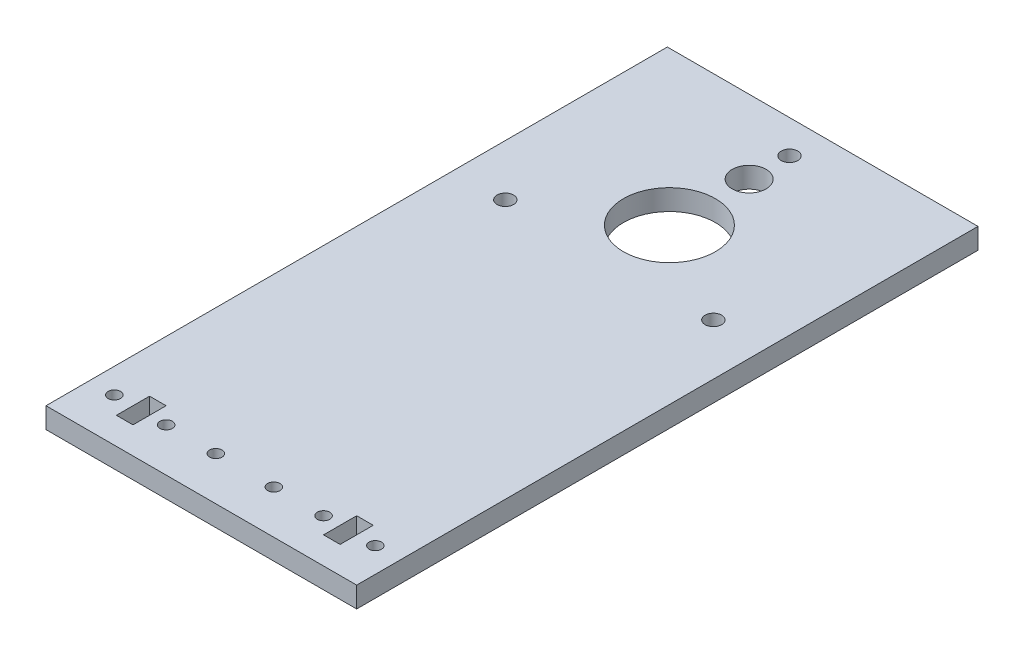
ISO-10303-21;
HEADER;
FILE_DESCRIPTION(('STEP AP214'),'2;1');
FILE_NAME('part.step','',(''),(''),'','','');
FILE_SCHEMA(('AUTOMOTIVE_DESIGN { 1 0 10303 214 1 1 1 1 }'));
ENDSEC;
DATA;
#1=APPLICATION_CONTEXT('core data for automotive mechanical design processes');
#2=APPLICATION_PROTOCOL_DEFINITION('international standard','automotive_design',2000,#1);
#3=PRODUCT_CONTEXT('',#1,'mechanical');
#4=PRODUCT('Part','Part','',(#3));
#5=PRODUCT_RELATED_PRODUCT_CATEGORY('part','',(#4));
#6=PRODUCT_DEFINITION_FORMATION('','',#4);
#7=PRODUCT_DEFINITION_CONTEXT('part definition',#1,'design');
#8=PRODUCT_DEFINITION('design','',#6,#7);
#9=PRODUCT_DEFINITION_SHAPE('','',#8);
#10=(LENGTH_UNIT() NAMED_UNIT(*) SI_UNIT(.MILLI.,.METRE.));
#11=(NAMED_UNIT(*) PLANE_ANGLE_UNIT() SI_UNIT($,.RADIAN.));
#12=(NAMED_UNIT(*) SI_UNIT($,.STERADIAN.) SOLID_ANGLE_UNIT());
#13=UNCERTAINTY_MEASURE_WITH_UNIT(LENGTH_MEASURE(1.E-05),#10,'distance_accuracy_value','');
#14=(GEOMETRIC_REPRESENTATION_CONTEXT(3) GLOBAL_UNCERTAINTY_ASSIGNED_CONTEXT((#13)) GLOBAL_UNIT_ASSIGNED_CONTEXT((#10,
#11,#12)) REPRESENTATION_CONTEXT('',''));
#15=CARTESIAN_POINT('',(0.,0.,0.));
#16=DIRECTION('',(0.,0.,1.));
#17=DIRECTION('',(1.,0.,0.));
#18=AXIS2_PLACEMENT_3D('',#15,#16,#17);
#19=CARTESIAN_POINT('',(10.5,5.,0.));
#20=DIRECTION('',(-1.,0.,0.));
#21=DIRECTION('',(0.,0.,1.));
#22=AXIS2_PLACEMENT_3D('',#19,#20,#21);
#23=PLANE('',#22);
#24=DIRECTION('',(0.,0.,-1.));
#25=VECTOR('',#24,1.);
#26=CARTESIAN_POINT('',(10.5,0.,0.));
#27=LINE('',#26,#25);
#28=CARTESIAN_POINT('',(10.5,0.,-6.50000000000001));
#29=VERTEX_POINT('',#28);
#30=CARTESIAN_POINT('',(10.5,0.,-14.5));
#31=VERTEX_POINT('',#30);
#32=EDGE_CURVE('E229',#29,#31,#27,.T.);
#33=ORIENTED_EDGE('',*,*,#32,.T.);
#34=DIRECTION('',(0.,-1.,0.));
#35=VECTOR('',#34,1.);
#36=CARTESIAN_POINT('',(10.5,5.,-14.5));
#37=LINE('',#36,#35);
#38=CARTESIAN_POINT('',(10.5,5.,-14.5));
#39=VERTEX_POINT('',#38);
#40=EDGE_CURVE('E11',#39,#31,#37,.T.);
#41=ORIENTED_EDGE('',*,*,#40,.F.);
#42=DIRECTION('',(0.,0.,-1.));
#43=VECTOR('',#42,1.);
#44=CARTESIAN_POINT('',(10.5,5.,0.));
#45=LINE('',#44,#43);
#46=CARTESIAN_POINT('',(10.5,5.,-6.50000000000001));
#47=VERTEX_POINT('',#46);
#48=EDGE_CURVE('E148',#47,#39,#45,.T.);
#49=ORIENTED_EDGE('',*,*,#48,.F.);
#50=DIRECTION('',(0.,-1.,0.));
#51=VECTOR('',#50,1.);
#52=CARTESIAN_POINT('',(10.5,5.,-6.50000000000001));
#53=LINE('',#52,#51);
#54=EDGE_CURVE('E247',#47,#29,#53,.T.);
#55=ORIENTED_EDGE('',*,*,#54,.T.);
#56=EDGE_LOOP('',(#33,#41,#49,#55));
#57=FACE_BOUND('',#56,.T.);
#58=ADVANCED_FACE('F40',(#57),#23,.F.);
#59=CARTESIAN_POINT('',(0.,5.,-14.5));
#60=DIRECTION('',(0.,0.,-1.));
#61=DIRECTION('',(-1.,0.,0.));
#62=AXIS2_PLACEMENT_3D('',#59,#60,#61);
#63=PLANE('',#62);
#64=DIRECTION('',(1.,0.,0.));
#65=VECTOR('',#64,1.);
#66=CARTESIAN_POINT('',(0.,0.,-14.5));
#67=LINE('',#66,#65);
#68=CARTESIAN_POINT('',(14.5,0.,-14.5));
#69=VERTEX_POINT('',#68);
#70=EDGE_CURVE('E154',#31,#69,#67,.T.);
#71=ORIENTED_EDGE('',*,*,#70,.T.);
#72=DIRECTION('',(0.,-1.,0.));
#73=VECTOR('',#72,1.);
#74=CARTESIAN_POINT('',(14.5,5.,-14.5));
#75=LINE('',#74,#73);
#76=CARTESIAN_POINT('',(14.5,5.,-14.5));
#77=VERTEX_POINT('',#76);
#78=EDGE_CURVE('E51',#77,#69,#75,.T.);
#79=ORIENTED_EDGE('',*,*,#78,.F.);
#80=DIRECTION('',(1.,0.,0.));
#81=VECTOR('',#80,1.);
#82=CARTESIAN_POINT('',(0.,5.,-14.5));
#83=LINE('',#82,#81);
#84=EDGE_CURVE('E141',#39,#77,#83,.T.);
#85=ORIENTED_EDGE('',*,*,#84,.F.);
#86=ORIENTED_EDGE('',*,*,#40,.T.);
#87=EDGE_LOOP('',(#71,#79,#85,#86));
#88=FACE_BOUND('',#87,.T.);
#89=ADVANCED_FACE('F153',(#88),#63,.F.);
#90=CARTESIAN_POINT('',(14.5,5.,0.));
#91=DIRECTION('',(1.,0.,0.));
#92=DIRECTION('',(0.,0.,-1.));
#93=AXIS2_PLACEMENT_3D('',#90,#91,#92);
#94=PLANE('',#93);
#95=DIRECTION('',(0.,0.,1.));
#96=VECTOR('',#95,1.);
#97=CARTESIAN_POINT('',(14.5,0.,0.));
#98=LINE('',#97,#96);
#99=CARTESIAN_POINT('',(14.5,0.,-6.50000000000001));
#100=VERTEX_POINT('',#99);
#101=EDGE_CURVE('E101',#69,#100,#98,.T.);
#102=ORIENTED_EDGE('',*,*,#101,.T.);
#103=DIRECTION('',(0.,-1.,0.));
#104=VECTOR('',#103,1.);
#105=CARTESIAN_POINT('',(14.5,5.,-6.50000000000001));
#106=LINE('',#105,#104);
#107=CARTESIAN_POINT('',(14.5,5.,-6.50000000000001));
#108=VERTEX_POINT('',#107);
#109=EDGE_CURVE('E156',#108,#100,#106,.T.);
#110=ORIENTED_EDGE('',*,*,#109,.F.);
#111=DIRECTION('',(0.,0.,1.));
#112=VECTOR('',#111,1.);
#113=CARTESIAN_POINT('',(14.5,5.,0.));
#114=LINE('',#113,#112);
#115=EDGE_CURVE('E146',#77,#108,#114,.T.);
#116=ORIENTED_EDGE('',*,*,#115,.F.);
#117=ORIENTED_EDGE('',*,*,#78,.T.);
#118=EDGE_LOOP('',(#102,#110,#116,#117));
#119=FACE_BOUND('',#118,.T.);
#120=ADVANCED_FACE('F158',(#119),#94,.F.);
#121=CARTESIAN_POINT('',(64.5,5.,0.));
#122=DIRECTION('',(-1.,0.,0.));
#123=DIRECTION('',(0.,0.,1.));
#124=AXIS2_PLACEMENT_3D('',#121,#122,#123);
#125=PLANE('',#124);
#126=DIRECTION('',(0.,0.,-1.));
#127=VECTOR('',#126,1.);
#128=CARTESIAN_POINT('',(64.5,0.,0.));
#129=LINE('',#128,#127);
#130=CARTESIAN_POINT('',(64.5,0.,-6.50000000000002));
#131=VERTEX_POINT('',#130);
#132=CARTESIAN_POINT('',(64.5,0.,-14.5));
#133=VERTEX_POINT('',#132);
#134=EDGE_CURVE('E197',#131,#133,#129,.T.);
#135=ORIENTED_EDGE('',*,*,#134,.F.);
#136=DIRECTION('',(0.,-1.,0.));
#137=VECTOR('',#136,1.);
#138=CARTESIAN_POINT('',(64.5,5.,-6.50000000000002));
#139=LINE('',#138,#137);
#140=CARTESIAN_POINT('',(64.5,5.,-6.50000000000002));
#141=VERTEX_POINT('',#140);
#142=EDGE_CURVE('E250',#141,#131,#139,.T.);
#143=ORIENTED_EDGE('',*,*,#142,.F.);
#144=DIRECTION('',(0.,0.,-1.));
#145=VECTOR('',#144,1.);
#146=CARTESIAN_POINT('',(64.5,5.,0.));
#147=LINE('',#146,#145);
#148=CARTESIAN_POINT('',(64.5,5.,-14.5));
#149=VERTEX_POINT('',#148);
#150=EDGE_CURVE('E401',#141,#149,#147,.T.);
#151=ORIENTED_EDGE('',*,*,#150,.T.);
#152=DIRECTION('',(0.,-1.,0.));
#153=VECTOR('',#152,1.);
#154=CARTESIAN_POINT('',(64.5,5.,-14.5));
#155=LINE('',#154,#153);
#156=EDGE_CURVE('E253',#149,#133,#155,.T.);
#157=ORIENTED_EDGE('',*,*,#156,.T.);
#158=EDGE_LOOP('',(#135,#143,#151,#157));
#159=FACE_BOUND('',#158,.T.);
#160=ADVANCED_FACE('F339',(#159),#125,.T.);
#161=CARTESIAN_POINT('',(0.,5.,-6.50000000000002));
#162=DIRECTION('',(0.,0.,-1.));
#163=DIRECTION('',(-1.,0.,0.));
#164=AXIS2_PLACEMENT_3D('',#161,#162,#163);
#165=PLANE('',#164);
#166=DIRECTION('',(1.,0.,0.));
#167=VECTOR('',#166,1.);
#168=CARTESIAN_POINT('',(0.,0.,-6.50000000000002));
#169=LINE('',#168,#167);
#170=CARTESIAN_POINT('',(60.5,0.,-6.50000000000002));
#171=VERTEX_POINT('',#170);
#172=EDGE_CURVE('E201',#171,#131,#169,.T.);
#173=ORIENTED_EDGE('',*,*,#172,.F.);
#174=DIRECTION('',(0.,-1.,0.));
#175=VECTOR('',#174,1.);
#176=CARTESIAN_POINT('',(60.5,5.,-6.50000000000002));
#177=LINE('',#176,#175);
#178=CARTESIAN_POINT('',(60.5,5.,-6.50000000000002));
#179=VERTEX_POINT('',#178);
#180=EDGE_CURVE('E260',#179,#171,#177,.T.);
#181=ORIENTED_EDGE('',*,*,#180,.F.);
#182=DIRECTION('',(1.,0.,0.));
#183=VECTOR('',#182,1.);
#184=CARTESIAN_POINT('',(0.,5.,-6.50000000000002));
#185=LINE('',#184,#183);
#186=EDGE_CURVE('E405',#179,#141,#185,.T.);
#187=ORIENTED_EDGE('',*,*,#186,.T.);
#188=ORIENTED_EDGE('',*,*,#142,.T.);
#189=EDGE_LOOP('',(#173,#181,#187,#188));
#190=FACE_BOUND('',#189,.T.);
#191=ADVANCED_FACE('F335',(#190),#165,.T.);
#192=CARTESIAN_POINT('',(60.5,5.,0.));
#193=DIRECTION('',(1.,0.,0.));
#194=DIRECTION('',(0.,0.,-1.));
#195=AXIS2_PLACEMENT_3D('',#192,#193,#194);
#196=PLANE('',#195);
#197=DIRECTION('',(0.,0.,1.));
#198=VECTOR('',#197,1.);
#199=CARTESIAN_POINT('',(60.5,0.,0.));
#200=LINE('',#199,#198);
#201=CARTESIAN_POINT('',(60.5,0.,-14.5));
#202=VERTEX_POINT('',#201);
#203=EDGE_CURVE('E205',#202,#171,#200,.T.);
#204=ORIENTED_EDGE('',*,*,#203,.F.);
#205=DIRECTION('',(0.,-1.,0.));
#206=VECTOR('',#205,1.);
#207=CARTESIAN_POINT('',(60.5,5.,-14.5));
#208=LINE('',#207,#206);
#209=CARTESIAN_POINT('',(60.5,5.,-14.5));
#210=VERTEX_POINT('',#209);
#211=EDGE_CURVE('E256',#210,#202,#208,.T.);
#212=ORIENTED_EDGE('',*,*,#211,.F.);
#213=DIRECTION('',(0.,0.,1.));
#214=VECTOR('',#213,1.);
#215=CARTESIAN_POINT('',(60.5,5.,0.));
#216=LINE('',#215,#214);
#217=EDGE_CURVE('E409',#210,#179,#216,.T.);
#218=ORIENTED_EDGE('',*,*,#217,.T.);
#219=ORIENTED_EDGE('',*,*,#180,.T.);
#220=EDGE_LOOP('',(#204,#212,#218,#219));
#221=FACE_BOUND('',#220,.T.);
#222=ADVANCED_FACE('F332',(#221),#196,.T.);
#223=CARTESIAN_POINT('',(0.,5.,0.));
#224=DIRECTION('',(0.,0.,-1.));
#225=DIRECTION('',(-1.,0.,0.));
#226=AXIS2_PLACEMENT_3D('',#223,#224,#225);
#227=PLANE('',#226);
#228=DIRECTION('',(1.,0.,0.));
#229=VECTOR('',#228,1.);
#230=CARTESIAN_POINT('',(0.,0.,0.));
#231=LINE('',#230,#229);
#232=CARTESIAN_POINT('',(0.,0.,0.));
#233=VERTEX_POINT('',#232);
#234=CARTESIAN_POINT('',(75.,0.,0.));
#235=VERTEX_POINT('',#234);
#236=EDGE_CURVE('E176',#233,#235,#231,.T.);
#237=ORIENTED_EDGE('',*,*,#236,.T.);
#238=DIRECTION('',(0.,-1.,0.));
#239=VECTOR('',#238,1.);
#240=CARTESIAN_POINT('',(75.,5.,0.));
#241=LINE('',#240,#239);
#242=CARTESIAN_POINT('',(75.,5.,0.));
#243=VERTEX_POINT('',#242);
#244=EDGE_CURVE('E257',#243,#235,#241,.T.);
#245=ORIENTED_EDGE('',*,*,#244,.F.);
#246=DIRECTION('',(1.,0.,0.));
#247=VECTOR('',#246,1.);
#248=CARTESIAN_POINT('',(0.,5.,0.));
#249=LINE('',#248,#247);
#250=CARTESIAN_POINT('',(0.,5.,0.));
#251=VERTEX_POINT('',#250);
#252=EDGE_CURVE('E246',#251,#243,#249,.T.);
#253=ORIENTED_EDGE('',*,*,#252,.F.);
#254=DIRECTION('',(0.,-1.,0.));
#255=VECTOR('',#254,1.);
#256=CARTESIAN_POINT('',(0.,5.,0.));
#257=LINE('',#256,#255);
#258=EDGE_CURVE('E175',#251,#233,#257,.T.);
#259=ORIENTED_EDGE('',*,*,#258,.T.);
#260=EDGE_LOOP('',(#237,#245,#253,#259));
#261=FACE_BOUND('',#260,.T.);
#262=ADVANCED_FACE('F42',(#261),#227,.F.);
#263=CARTESIAN_POINT('',(75.,5.,0.));
#264=DIRECTION('',(-1.,0.,0.));
#265=DIRECTION('',(0.,0.,1.));
#266=AXIS2_PLACEMENT_3D('',#263,#264,#265);
#267=PLANE('',#266);
#268=DIRECTION('',(0.,0.,-1.));
#269=VECTOR('',#268,1.);
#270=CARTESIAN_POINT('',(75.,0.,0.));
#271=LINE('',#270,#269);
#272=CARTESIAN_POINT('',(75.,0.,-150.));
#273=VERTEX_POINT('',#272);
#274=EDGE_CURVE('E180',#235,#273,#271,.T.);
#275=ORIENTED_EDGE('',*,*,#274,.T.);
#276=DIRECTION('',(0.,-1.,0.));
#277=VECTOR('',#276,1.);
#278=CARTESIAN_POINT('',(75.,5.,-150.));
#279=LINE('',#278,#277);
#280=CARTESIAN_POINT('',(75.,5.,-150.));
#281=VERTEX_POINT('',#280);
#282=EDGE_CURVE('E272',#281,#273,#279,.T.);
#283=ORIENTED_EDGE('',*,*,#282,.F.);
#284=DIRECTION('',(0.,0.,-1.));
#285=VECTOR('',#284,1.);
#286=CARTESIAN_POINT('',(75.,5.,0.));
#287=LINE('',#286,#285);
#288=EDGE_CURVE('E116',#243,#281,#287,.T.);
#289=ORIENTED_EDGE('',*,*,#288,.F.);
#290=ORIENTED_EDGE('',*,*,#244,.T.);
#291=EDGE_LOOP('',(#275,#283,#289,#290));
#292=FACE_BOUND('',#291,.T.);
#293=ADVANCED_FACE('F359',(#292),#267,.F.);
#294=CARTESIAN_POINT('',(0.,5.,-150.));
#295=DIRECTION('',(0.,0.,1.));
#296=DIRECTION('',(1.,0.,0.));
#297=AXIS2_PLACEMENT_3D('',#294,#295,#296);
#298=PLANE('',#297);
#299=DIRECTION('',(-1.,0.,0.));
#300=VECTOR('',#299,1.);
#301=CARTESIAN_POINT('',(0.,0.,-150.));
#302=LINE('',#301,#300);
#303=CARTESIAN_POINT('',(0.,0.,-150.));
#304=VERTEX_POINT('',#303);
#305=EDGE_CURVE('E183',#273,#304,#302,.T.);
#306=ORIENTED_EDGE('',*,*,#305,.T.);
#307=DIRECTION('',(0.,-1.,0.));
#308=VECTOR('',#307,1.);
#309=CARTESIAN_POINT('',(0.,5.,-150.));
#310=LINE('',#309,#308);
#311=CARTESIAN_POINT('',(0.,5.,-150.));
#312=VERTEX_POINT('',#311);
#313=EDGE_CURVE('E268',#312,#304,#310,.T.);
#314=ORIENTED_EDGE('',*,*,#313,.F.);
#315=DIRECTION('',(-1.,0.,0.));
#316=VECTOR('',#315,1.);
#317=CARTESIAN_POINT('',(0.,5.,-150.));
#318=LINE('',#317,#316);
#319=EDGE_CURVE('E372',#281,#312,#318,.T.);
#320=ORIENTED_EDGE('',*,*,#319,.F.);
#321=ORIENTED_EDGE('',*,*,#282,.T.);
#322=EDGE_LOOP('',(#306,#314,#320,#321));
#323=FACE_BOUND('',#322,.T.);
#324=ADVANCED_FACE('F356',(#323),#298,.F.);
#325=CARTESIAN_POINT('',(30.5,5.,-10.5));
#326=DIRECTION('',(0.,-1.,0.));
#327=DIRECTION('',(0.,0.,-1.));
#328=AXIS2_PLACEMENT_3D('',#325,#326,#327);
#329=CYLINDRICAL_SURFACE('',#328,1.5);
#330=CARTESIAN_POINT('',(30.5,5.,-10.5));
#331=DIRECTION('',(0.,1.,0.));
#332=DIRECTION('',(0.,0.,1.));
#333=AXIS2_PLACEMENT_3D('',#330,#331,#332);
#334=CIRCLE('',#333,1.5);
#335=CARTESIAN_POINT('',(30.5,5.,-9.00000000000001));
#336=VERTEX_POINT('',#335);
#337=EDGE_CURVE('E164',#336,#336,#334,.F.);
#338=ORIENTED_EDGE('',*,*,#337,.F.);
#339=EDGE_LOOP('',(#338));
#340=FACE_BOUND('',#339,.T.);
#341=CARTESIAN_POINT('',(30.5,0.,-10.5));
#342=DIRECTION('',(0.,1.,0.));
#343=DIRECTION('',(0.,0.,1.));
#344=AXIS2_PLACEMENT_3D('',#341,#342,#343);
#345=CIRCLE('',#344,1.5);
#346=CARTESIAN_POINT('',(30.5,0.,-9.00000000000001));
#347=VERTEX_POINT('',#346);
#348=EDGE_CURVE('E238',#347,#347,#345,.F.);
#349=ORIENTED_EDGE('',*,*,#348,.T.);
#350=EDGE_LOOP('',(#349));
#351=FACE_BOUND('',#350,.T.);
#352=ADVANCED_FACE('F358',(#340,#351),#329,.F.);
#353=CARTESIAN_POINT('',(0.,5.,-6.50000000000001));
#354=DIRECTION('',(0.,0.,1.));
#355=DIRECTION('',(1.,0.,0.));
#356=AXIS2_PLACEMENT_3D('',#353,#354,#355);
#357=PLANE('',#356);
#358=DIRECTION('',(-1.,0.,0.));
#359=VECTOR('',#358,1.);
#360=CARTESIAN_POINT('',(0.,0.,-6.50000000000001));
#361=LINE('',#360,#359);
#362=EDGE_CURVE('E107',#100,#29,#361,.T.);
#363=ORIENTED_EDGE('',*,*,#362,.T.);
#364=ORIENTED_EDGE('',*,*,#54,.F.);
#365=DIRECTION('',(-1.,0.,0.));
#366=VECTOR('',#365,1.);
#367=CARTESIAN_POINT('',(0.,5.,-6.50000000000001));
#368=LINE('',#367,#366);
#369=EDGE_CURVE('E60',#108,#47,#368,.T.);
#370=ORIENTED_EDGE('',*,*,#369,.F.);
#371=ORIENTED_EDGE('',*,*,#109,.T.);
#372=EDGE_LOOP('',(#363,#364,#370,#371));
#373=FACE_BOUND('',#372,.T.);
#374=ADVANCED_FACE('F314',(#373),#357,.F.);
#375=CARTESIAN_POINT('',(18.5,5.,-10.5));
#376=DIRECTION('',(0.,-1.,0.));
#377=DIRECTION('',(0.,0.,-1.));
#378=AXIS2_PLACEMENT_3D('',#375,#376,#377);
#379=CYLINDRICAL_SURFACE('',#378,1.5);
#380=CARTESIAN_POINT('',(18.5,5.,-10.5));
#381=DIRECTION('',(0.,1.,0.));
#382=DIRECTION('',(0.,0.,1.));
#383=AXIS2_PLACEMENT_3D('',#380,#381,#382);
#384=CIRCLE('',#383,1.5);
#385=CARTESIAN_POINT('',(18.5,5.,-9.00000000000001));
#386=VERTEX_POINT('',#385);
#387=EDGE_CURVE('E429',#386,#386,#384,.F.);
#388=ORIENTED_EDGE('',*,*,#387,.F.);
#389=EDGE_LOOP('',(#388));
#390=FACE_BOUND('',#389,.T.);
#391=CARTESIAN_POINT('',(18.5,0.,-10.5));
#392=DIRECTION('',(0.,1.,0.));
#393=DIRECTION('',(0.,0.,1.));
#394=AXIS2_PLACEMENT_3D('',#391,#392,#393);
#395=CIRCLE('',#394,1.5);
#396=CARTESIAN_POINT('',(18.5,0.,-9.00000000000001));
#397=VERTEX_POINT('',#396);
#398=EDGE_CURVE('E225',#397,#397,#395,.F.);
#399=ORIENTED_EDGE('',*,*,#398,.T.);
#400=EDGE_LOOP('',(#399));
#401=FACE_BOUND('',#400,.T.);
#402=ADVANCED_FACE('F310',(#390,#401),#379,.F.);
#403=CARTESIAN_POINT('',(69.,5.,-10.5));
#404=DIRECTION('',(0.,-1.,0.));
#405=DIRECTION('',(0.,0.,-1.));
#406=AXIS2_PLACEMENT_3D('',#403,#404,#405);
#407=CYLINDRICAL_SURFACE('',#406,1.5);
#408=CARTESIAN_POINT('',(69.,5.,-10.5));
#409=DIRECTION('',(0.,1.,0.));
#410=DIRECTION('',(0.,0.,1.));
#411=AXIS2_PLACEMENT_3D('',#408,#409,#410);
#412=CIRCLE('',#411,1.5);
#413=CARTESIAN_POINT('',(69.,5.,-9.00000000000002));
#414=VERTEX_POINT('',#413);
#415=EDGE_CURVE('E425',#414,#414,#412,.T.);
#416=ORIENTED_EDGE('',*,*,#415,.T.);
#417=EDGE_LOOP('',(#416));
#418=FACE_BOUND('',#417,.T.);
#419=CARTESIAN_POINT('',(69.,0.,-10.5));
#420=DIRECTION('',(0.,1.,0.));
#421=DIRECTION('',(0.,0.,1.));
#422=AXIS2_PLACEMENT_3D('',#419,#420,#421);
#423=CIRCLE('',#422,1.5);
#424=CARTESIAN_POINT('',(69.,0.,-9.00000000000002));
#425=VERTEX_POINT('',#424);
#426=EDGE_CURVE('E221',#425,#425,#423,.T.);
#427=ORIENTED_EDGE('',*,*,#426,.F.);
#428=EDGE_LOOP('',(#427));
#429=FACE_BOUND('',#428,.T.);
#430=ADVANCED_FACE('F313',(#418,#429),#407,.F.);
#431=CARTESIAN_POINT('',(37.5,5.,-132.25));
#432=DIRECTION('',(0.,-1.,0.));
#433=DIRECTION('',(0.,0.,-1.));
#434=AXIS2_PLACEMENT_3D('',#431,#432,#433);
#435=CYLINDRICAL_SURFACE('',#434,4.1);
#436=CARTESIAN_POINT('',(37.5,5.,-132.25));
#437=DIRECTION('',(0.,1.,0.));
#438=DIRECTION('',(0.,0.,1.));
#439=AXIS2_PLACEMENT_3D('',#436,#437,#438);
#440=CIRCLE('',#439,4.1);
#441=CARTESIAN_POINT('',(37.5,5.,-128.15));
#442=VERTEX_POINT('',#441);
#443=EDGE_CURVE('E421',#442,#442,#440,.T.);
#444=ORIENTED_EDGE('',*,*,#443,.T.);
#445=EDGE_LOOP('',(#444));
#446=FACE_BOUND('',#445,.T.);
#447=CARTESIAN_POINT('',(37.5,0.,-132.25));
#448=DIRECTION('',(0.,1.,0.));
#449=DIRECTION('',(0.,0.,1.));
#450=AXIS2_PLACEMENT_3D('',#447,#448,#449);
#451=CIRCLE('',#450,4.1);
#452=CARTESIAN_POINT('',(37.5,0.,-128.15));
#453=VERTEX_POINT('',#452);
#454=EDGE_CURVE('E217',#453,#453,#451,.T.);
#455=ORIENTED_EDGE('',*,*,#454,.F.);
#456=EDGE_LOOP('',(#455));
#457=FACE_BOUND('',#456,.T.);
#458=ADVANCED_FACE('F318',(#446,#457),#435,.F.);
#459=CARTESIAN_POINT('',(37.5,5.,-113.));
#460=DIRECTION('',(0.,-1.,0.));
#461=DIRECTION('',(0.,0.,-1.));
#462=AXIS2_PLACEMENT_3D('',#459,#460,#461);
#463=CYLINDRICAL_SURFACE('',#462,11.1);
#464=CARTESIAN_POINT('',(37.5,5.,-113.));
#465=DIRECTION('',(0.,1.,0.));
#466=DIRECTION('',(0.,0.,1.));
#467=AXIS2_PLACEMENT_3D('',#464,#465,#466);
#468=CIRCLE('',#467,11.1);
#469=CARTESIAN_POINT('',(37.5,5.,-101.9));
#470=VERTEX_POINT('',#469);
#471=EDGE_CURVE('E417',#470,#470,#468,.T.);
#472=ORIENTED_EDGE('',*,*,#471,.T.);
#473=EDGE_LOOP('',(#472));
#474=FACE_BOUND('',#473,.T.);
#475=CARTESIAN_POINT('',(37.5,0.,-113.));
#476=DIRECTION('',(0.,1.,0.));
#477=DIRECTION('',(0.,0.,1.));
#478=AXIS2_PLACEMENT_3D('',#475,#476,#477);
#479=CIRCLE('',#478,11.1);
#480=CARTESIAN_POINT('',(37.5,0.,-101.9));
#481=VERTEX_POINT('',#480);
#482=EDGE_CURVE('E213',#481,#481,#479,.T.);
#483=ORIENTED_EDGE('',*,*,#482,.F.);
#484=EDGE_LOOP('',(#483));
#485=FACE_BOUND('',#484,.T.);
#486=ADVANCED_FACE('F322',(#474,#485),#463,.F.);
#487=CARTESIAN_POINT('',(0.,5.,-14.4999999999998));
#488=DIRECTION('',(0.,0.,1.));
#489=DIRECTION('',(1.,0.,0.));
#490=AXIS2_PLACEMENT_3D('',#487,#488,#489);
#491=PLANE('',#490);
#492=DIRECTION('',(-1.,0.,0.));
#493=VECTOR('',#492,1.);
#494=CARTESIAN_POINT('',(0.,0.,-14.4999999999998));
#495=LINE('',#494,#493);
#496=EDGE_CURVE('E209',#133,#202,#495,.T.);
#497=ORIENTED_EDGE('',*,*,#496,.F.);
#498=ORIENTED_EDGE('',*,*,#156,.F.);
#499=DIRECTION('',(-1.,0.,0.));
#500=VECTOR('',#499,1.);
#501=CARTESIAN_POINT('',(0.,5.,-14.4999999999998));
#502=LINE('',#501,#500);
#503=EDGE_CURVE('E413',#149,#210,#502,.T.);
#504=ORIENTED_EDGE('',*,*,#503,.T.);
#505=ORIENTED_EDGE('',*,*,#211,.T.);
#506=EDGE_LOOP('',(#497,#498,#504,#505));
#507=FACE_BOUND('',#506,.T.);
#508=ADVANCED_FACE('F326',(#507),#491,.T.);
#509=CARTESIAN_POINT('',(56.5,5.,-10.5));
#510=DIRECTION('',(0.,-1.,0.));
#511=DIRECTION('',(0.,0.,-1.));
#512=AXIS2_PLACEMENT_3D('',#509,#510,#511);
#513=CYLINDRICAL_SURFACE('',#512,1.5);
#514=CARTESIAN_POINT('',(56.5,5.,-10.5));
#515=DIRECTION('',(0.,1.,0.));
#516=DIRECTION('',(0.,0.,1.));
#517=AXIS2_PLACEMENT_3D('',#514,#515,#516);
#518=CIRCLE('',#517,1.5);
#519=CARTESIAN_POINT('',(56.5,5.,-9.00000000000001));
#520=VERTEX_POINT('',#519);
#521=EDGE_CURVE('E397',#520,#520,#518,.T.);
#522=ORIENTED_EDGE('',*,*,#521,.T.);
#523=EDGE_LOOP('',(#522));
#524=FACE_BOUND('',#523,.T.);
#525=CARTESIAN_POINT('',(56.5,0.,-10.5));
#526=DIRECTION('',(0.,1.,0.));
#527=DIRECTION('',(0.,0.,1.));
#528=AXIS2_PLACEMENT_3D('',#525,#526,#527);
#529=CIRCLE('',#528,1.5);
#530=CARTESIAN_POINT('',(56.5,0.,-9.00000000000001));
#531=VERTEX_POINT('',#530);
#532=EDGE_CURVE('E193',#531,#531,#529,.T.);
#533=ORIENTED_EDGE('',*,*,#532,.F.);
#534=EDGE_LOOP('',(#533));
#535=FACE_BOUND('',#534,.T.);
#536=ADVANCED_FACE('F330',(#524,#535),#513,.F.);
#537=CARTESIAN_POINT('',(44.5,5.,-10.5));
#538=DIRECTION('',(0.,-1.,0.));
#539=DIRECTION('',(0.,0.,-1.));
#540=AXIS2_PLACEMENT_3D('',#537,#538,#539);
#541=CYLINDRICAL_SURFACE('',#540,1.5);
#542=CARTESIAN_POINT('',(44.5,5.,-10.5));
#543=DIRECTION('',(0.,1.,0.));
#544=DIRECTION('',(0.,0.,1.));
#545=AXIS2_PLACEMENT_3D('',#542,#543,#544);
#546=CIRCLE('',#545,1.5);
#547=CARTESIAN_POINT('',(44.5,5.,-9.00000000000001));
#548=VERTEX_POINT('',#547);
#549=EDGE_CURVE('E393',#548,#548,#546,.T.);
#550=ORIENTED_EDGE('',*,*,#549,.T.);
#551=EDGE_LOOP('',(#550));
#552=FACE_BOUND('',#551,.T.);
#553=CARTESIAN_POINT('',(44.5,0.,-10.5));
#554=DIRECTION('',(0.,1.,0.));
#555=DIRECTION('',(0.,0.,1.));
#556=AXIS2_PLACEMENT_3D('',#553,#554,#555);
#557=CIRCLE('',#556,1.5);
#558=CARTESIAN_POINT('',(44.5,0.,-9.00000000000001));
#559=VERTEX_POINT('',#558);
#560=EDGE_CURVE('E189',#559,#559,#557,.T.);
#561=ORIENTED_EDGE('',*,*,#560,.F.);
#562=EDGE_LOOP('',(#561));
#563=FACE_BOUND('',#562,.T.);
#564=ADVANCED_FACE('F346',(#552,#563),#541,.F.);
#565=CARTESIAN_POINT('',(0.,5.,0.));
#566=DIRECTION('',(1.,0.,0.));
#567=DIRECTION('',(0.,0.,-1.));
#568=AXIS2_PLACEMENT_3D('',#565,#566,#567);
#569=PLANE('',#568);
#570=DIRECTION('',(0.,0.,1.));
#571=VECTOR('',#570,1.);
#572=CARTESIAN_POINT('',(0.,0.,0.));
#573=LINE('',#572,#571);
#574=EDGE_CURVE('E186',#304,#233,#573,.T.);
#575=ORIENTED_EDGE('',*,*,#574,.T.);
#576=ORIENTED_EDGE('',*,*,#258,.F.);
#577=DIRECTION('',(0.,0.,1.));
#578=VECTOR('',#577,1.);
#579=CARTESIAN_POINT('',(0.,5.,0.));
#580=LINE('',#579,#578);
#581=EDGE_CURVE('E390',#312,#251,#580,.T.);
#582=ORIENTED_EDGE('',*,*,#581,.F.);
#583=ORIENTED_EDGE('',*,*,#313,.T.);
#584=EDGE_LOOP('',(#575,#576,#582,#583));
#585=FACE_BOUND('',#584,.T.);
#586=ADVANCED_FACE('F350',(#585),#569,.F.);
#587=CARTESIAN_POINT('',(5.99999999999999,5.,-10.5));
#588=DIRECTION('',(0.,-1.,0.));
#589=DIRECTION('',(0.,0.,-1.));
#590=AXIS2_PLACEMENT_3D('',#587,#588,#589);
#591=CYLINDRICAL_SURFACE('',#590,1.5);
#592=CARTESIAN_POINT('',(5.99999999999999,5.,-10.5));
#593=DIRECTION('',(0.,1.,0.));
#594=DIRECTION('',(0.,0.,1.));
#595=AXIS2_PLACEMENT_3D('',#592,#593,#594);
#596=CIRCLE('',#595,1.5);
#597=CARTESIAN_POINT('',(5.99999999999999,5.,-9.00000000000002));
#598=VERTEX_POINT('',#597);
#599=EDGE_CURVE('E171',#598,#598,#596,.F.);
#600=ORIENTED_EDGE('',*,*,#599,.F.);
#601=EDGE_LOOP('',(#600));
#602=FACE_BOUND('',#601,.T.);
#603=CARTESIAN_POINT('',(5.99999999999999,0.,-10.5));
#604=DIRECTION('',(0.,1.,0.));
#605=DIRECTION('',(0.,0.,1.));
#606=AXIS2_PLACEMENT_3D('',#603,#604,#605);
#607=CIRCLE('',#606,1.5);
#608=CARTESIAN_POINT('',(5.99999999999999,0.,-9.00000000000002));
#609=VERTEX_POINT('',#608);
#610=EDGE_CURVE('E242',#609,#609,#607,.F.);
#611=ORIENTED_EDGE('',*,*,#610,.T.);
#612=EDGE_LOOP('',(#611));
#613=FACE_BOUND('',#612,.T.);
#614=ADVANCED_FACE('F354',(#602,#613),#591,.F.);
#615=CARTESIAN_POINT('',(0.,5.,0.));
#616=DIRECTION('',(0.,1.,0.));
#617=DIRECTION('',(0.,0.,1.));
#618=AXIS2_PLACEMENT_3D('',#615,#616,#617);
#619=PLANE('',#618);
#620=CARTESIAN_POINT('',(12.3852632902524,5.,-98.4999999999995));
#621=DIRECTION('',(0.,1.,0.));
#622=DIRECTION('',(0.,0.,1.));
#623=AXIS2_PLACEMENT_3D('',#620,#621,#622);
#624=CIRCLE('',#623,2.00000000000002);
#625=CARTESIAN_POINT('',(12.3852632902524,5.,-96.4999999999995));
#626=VERTEX_POINT('',#625);
#627=EDGE_CURVE('E280',#626,#626,#624,.T.);
#628=ORIENTED_EDGE('',*,*,#627,.F.);
#629=EDGE_LOOP('',(#628));
#630=FACE_BOUND('',#629,.T.);
#631=CARTESIAN_POINT('',(62.6147367097498,5.,-98.5000000000006));
#632=DIRECTION('',(0.,1.,0.));
#633=DIRECTION('',(0.,0.,1.));
#634=AXIS2_PLACEMENT_3D('',#631,#632,#633);
#635=CIRCLE('',#634,2.);
#636=CARTESIAN_POINT('',(62.6147367097498,5.,-96.5000000000006));
#637=VERTEX_POINT('',#636);
#638=EDGE_CURVE('E582',#637,#637,#635,.T.);
#639=ORIENTED_EDGE('',*,*,#638,.F.);
#640=EDGE_LOOP('',(#639));
#641=FACE_BOUND('',#640,.T.);
#642=CARTESIAN_POINT('',(37.5,5.,-142.));
#643=DIRECTION('',(0.,1.,0.));
#644=DIRECTION('',(0.,0.,1.));
#645=AXIS2_PLACEMENT_3D('',#642,#643,#644);
#646=CIRCLE('',#645,2.);
#647=CARTESIAN_POINT('',(37.5,5.,-140.));
#648=VERTEX_POINT('',#647);
#649=EDGE_CURVE('E385',#648,#648,#646,.T.);
#650=ORIENTED_EDGE('',*,*,#649,.F.);
#651=EDGE_LOOP('',(#650));
#652=FACE_BOUND('',#651,.T.);
#653=ORIENTED_EDGE('',*,*,#252,.T.);
#654=ORIENTED_EDGE('',*,*,#288,.T.);
#655=ORIENTED_EDGE('',*,*,#319,.T.);
#656=ORIENTED_EDGE('',*,*,#581,.T.);
#657=EDGE_LOOP('',(#653,#654,#655,#656));
#658=FACE_BOUND('',#657,.T.);
#659=ORIENTED_EDGE('',*,*,#549,.F.);
#660=EDGE_LOOP('',(#659));
#661=FACE_BOUND('',#660,.T.);
#662=ORIENTED_EDGE('',*,*,#521,.F.);
#663=EDGE_LOOP('',(#662));
#664=FACE_BOUND('',#663,.T.);
#665=ORIENTED_EDGE('',*,*,#150,.F.);
#666=ORIENTED_EDGE('',*,*,#186,.F.);
#667=ORIENTED_EDGE('',*,*,#217,.F.);
#668=ORIENTED_EDGE('',*,*,#503,.F.);
#669=EDGE_LOOP('',(#665,#666,#667,#668));
#670=FACE_BOUND('',#669,.T.);
#671=ORIENTED_EDGE('',*,*,#471,.F.);
#672=EDGE_LOOP('',(#671));
#673=FACE_BOUND('',#672,.T.);
#674=ORIENTED_EDGE('',*,*,#443,.F.);
#675=EDGE_LOOP('',(#674));
#676=FACE_BOUND('',#675,.T.);
#677=ORIENTED_EDGE('',*,*,#415,.F.);
#678=EDGE_LOOP('',(#677));
#679=FACE_BOUND('',#678,.T.);
#680=ORIENTED_EDGE('',*,*,#387,.T.);
#681=EDGE_LOOP('',(#680));
#682=FACE_BOUND('',#681,.T.);
#683=ORIENTED_EDGE('',*,*,#48,.T.);
#684=ORIENTED_EDGE('',*,*,#84,.T.);
#685=ORIENTED_EDGE('',*,*,#115,.T.);
#686=ORIENTED_EDGE('',*,*,#369,.T.);
#687=EDGE_LOOP('',(#683,#684,#685,#686));
#688=FACE_BOUND('',#687,.T.);
#689=ORIENTED_EDGE('',*,*,#337,.T.);
#690=EDGE_LOOP('',(#689));
#691=FACE_BOUND('',#690,.T.);
#692=ORIENTED_EDGE('',*,*,#599,.T.);
#693=EDGE_LOOP('',(#692));
#694=FACE_BOUND('',#693,.T.);
#695=ADVANCED_FACE('F143',(#630,#641,#652,#658,#661,#664,#670,#673,#676,#679,#682,#688,#691,
#694),#619,.T.);
#696=CARTESIAN_POINT('',(0.,0.,0.));
#697=DIRECTION('',(0.,1.,0.));
#698=DIRECTION('',(0.,0.,1.));
#699=AXIS2_PLACEMENT_3D('',#696,#697,#698);
#700=PLANE('',#699);
#701=CARTESIAN_POINT('',(12.3852632902524,0.,-98.4999999999995));
#702=DIRECTION('',(0.,1.,0.));
#703=DIRECTION('',(0.,0.,1.));
#704=AXIS2_PLACEMENT_3D('',#701,#702,#703);
#705=CIRCLE('',#704,2.00000000000002);
#706=CARTESIAN_POINT('',(12.3852632902524,0.,-96.4999999999995));
#707=VERTEX_POINT('',#706);
#708=EDGE_CURVE('E44',#707,#707,#705,.T.);
#709=ORIENTED_EDGE('',*,*,#708,.T.);
#710=EDGE_LOOP('',(#709));
#711=FACE_BOUND('',#710,.T.);
#712=CARTESIAN_POINT('',(62.6147367097498,0.,-98.5000000000006));
#713=DIRECTION('',(0.,1.,0.));
#714=DIRECTION('',(0.,0.,1.));
#715=AXIS2_PLACEMENT_3D('',#712,#713,#714);
#716=CIRCLE('',#715,2.);
#717=CARTESIAN_POINT('',(62.6147367097498,0.,-96.5000000000006));
#718=VERTEX_POINT('',#717);
#719=EDGE_CURVE('E279',#718,#718,#716,.T.);
#720=ORIENTED_EDGE('',*,*,#719,.T.);
#721=EDGE_LOOP('',(#720));
#722=FACE_BOUND('',#721,.T.);
#723=CARTESIAN_POINT('',(37.5,0.,-142.));
#724=DIRECTION('',(0.,1.,0.));
#725=DIRECTION('',(0.,0.,1.));
#726=AXIS2_PLACEMENT_3D('',#723,#724,#725);
#727=CIRCLE('',#726,2.);
#728=CARTESIAN_POINT('',(37.5,0.,-140.));
#729=VERTEX_POINT('',#728);
#730=EDGE_CURVE('E277',#729,#729,#727,.T.);
#731=ORIENTED_EDGE('',*,*,#730,.T.);
#732=EDGE_LOOP('',(#731));
#733=FACE_BOUND('',#732,.T.);
#734=ORIENTED_EDGE('',*,*,#236,.F.);
#735=ORIENTED_EDGE('',*,*,#574,.F.);
#736=ORIENTED_EDGE('',*,*,#305,.F.);
#737=ORIENTED_EDGE('',*,*,#274,.F.);
#738=EDGE_LOOP('',(#734,#735,#736,#737));
#739=FACE_BOUND('',#738,.T.);
#740=ORIENTED_EDGE('',*,*,#560,.T.);
#741=EDGE_LOOP('',(#740));
#742=FACE_BOUND('',#741,.T.);
#743=ORIENTED_EDGE('',*,*,#532,.T.);
#744=EDGE_LOOP('',(#743));
#745=FACE_BOUND('',#744,.T.);
#746=ORIENTED_EDGE('',*,*,#134,.T.);
#747=ORIENTED_EDGE('',*,*,#496,.T.);
#748=ORIENTED_EDGE('',*,*,#203,.T.);
#749=ORIENTED_EDGE('',*,*,#172,.T.);
#750=EDGE_LOOP('',(#746,#747,#748,#749));
#751=FACE_BOUND('',#750,.T.);
#752=ORIENTED_EDGE('',*,*,#482,.T.);
#753=EDGE_LOOP('',(#752));
#754=FACE_BOUND('',#753,.T.);
#755=ORIENTED_EDGE('',*,*,#454,.T.);
#756=EDGE_LOOP('',(#755));
#757=FACE_BOUND('',#756,.T.);
#758=ORIENTED_EDGE('',*,*,#426,.T.);
#759=EDGE_LOOP('',(#758));
#760=FACE_BOUND('',#759,.T.);
#761=ORIENTED_EDGE('',*,*,#398,.F.);
#762=EDGE_LOOP('',(#761));
#763=FACE_BOUND('',#762,.T.);
#764=ORIENTED_EDGE('',*,*,#32,.F.);
#765=ORIENTED_EDGE('',*,*,#362,.F.);
#766=ORIENTED_EDGE('',*,*,#101,.F.);
#767=ORIENTED_EDGE('',*,*,#70,.F.);
#768=EDGE_LOOP('',(#764,#765,#766,#767));
#769=FACE_BOUND('',#768,.T.);
#770=ORIENTED_EDGE('',*,*,#348,.F.);
#771=EDGE_LOOP('',(#770));
#772=FACE_BOUND('',#771,.T.);
#773=ORIENTED_EDGE('',*,*,#610,.F.);
#774=EDGE_LOOP('',(#773));
#775=FACE_BOUND('',#774,.T.);
#776=ADVANCED_FACE('F287',(#711,#722,#733,#739,#742,#745,#751,#754,#757,#760,#763,#769,#772,
#775),#700,.F.);
#777=CARTESIAN_POINT('',(37.5,-5.,-142.));
#778=DIRECTION('',(0.,1.,0.));
#779=DIRECTION('',(0.,0.,1.));
#780=AXIS2_PLACEMENT_3D('',#777,#778,#779);
#781=CYLINDRICAL_SURFACE('',#780,2.);
#782=ORIENTED_EDGE('',*,*,#649,.T.);
#783=EDGE_LOOP('',(#782));
#784=FACE_BOUND('',#783,.T.);
#785=ORIENTED_EDGE('',*,*,#730,.F.);
#786=EDGE_LOOP('',(#785));
#787=FACE_BOUND('',#786,.T.);
#788=ADVANCED_FACE('F297',(#784,#787),#781,.F.);
#789=CARTESIAN_POINT('',(62.6147367097498,-5.,-98.5000000000006));
#790=DIRECTION('',(0.,1.,0.));
#791=DIRECTION('',(0.,0.,1.));
#792=AXIS2_PLACEMENT_3D('',#789,#790,#791);
#793=CYLINDRICAL_SURFACE('',#792,2.);
#794=ORIENTED_EDGE('',*,*,#638,.T.);
#795=EDGE_LOOP('',(#794));
#796=FACE_BOUND('',#795,.T.);
#797=ORIENTED_EDGE('',*,*,#719,.F.);
#798=EDGE_LOOP('',(#797));
#799=FACE_BOUND('',#798,.T.);
#800=ADVANCED_FACE('F291',(#796,#799),#793,.F.);
#801=CARTESIAN_POINT('',(12.3852632902524,-5.,-98.4999999999995));
#802=DIRECTION('',(0.,1.,0.));
#803=DIRECTION('',(0.,0.,1.));
#804=AXIS2_PLACEMENT_3D('',#801,#802,#803);
#805=CYLINDRICAL_SURFACE('',#804,2.00000000000002);
#806=ORIENTED_EDGE('',*,*,#627,.T.);
#807=EDGE_LOOP('',(#806));
#808=FACE_BOUND('',#807,.T.);
#809=ORIENTED_EDGE('',*,*,#708,.F.);
#810=EDGE_LOOP('',(#809));
#811=FACE_BOUND('',#810,.T.);
#812=ADVANCED_FACE('F289',(#808,#811),#805,.F.);
#813=CLOSED_SHELL('',(#58,#89,#120,#160,#191,#222,#262,#293,#324,#352,#374,#402,#430,#458,#486,
#508,#536,#564,#586,#614,#695,#776,#788,#800,#812));
#814=MANIFOLD_SOLID_BREP('B2',#813);
#815=ADVANCED_BREP_SHAPE_REPRESENTATION('',(#18,#814),#14);
#816=SHAPE_DEFINITION_REPRESENTATION(#9,#815);
ENDSEC;
END-ISO-10303-21;
